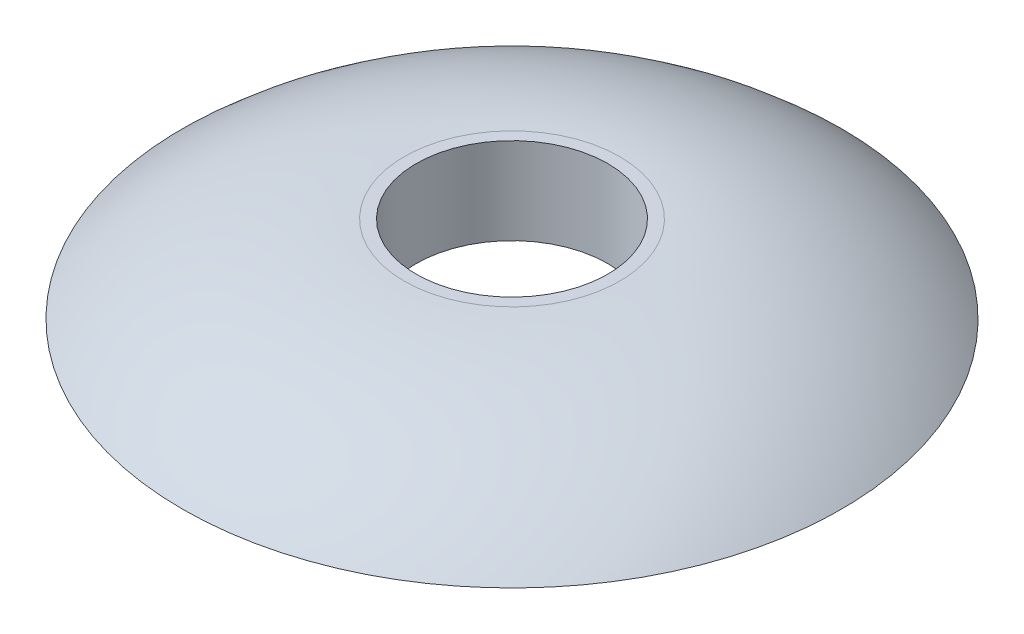
ISO-10303-21;
HEADER;
FILE_DESCRIPTION(('STEP AP214'),'2;1');
FILE_NAME('part.step','',(''),(''),'','','');
FILE_SCHEMA(('AUTOMOTIVE_DESIGN { 1 0 10303 214 1 1 1 1 }'));
ENDSEC;
DATA;
#1=APPLICATION_CONTEXT('core data for automotive mechanical design processes');
#2=APPLICATION_PROTOCOL_DEFINITION('international standard','automotive_design',2000,#1);
#3=PRODUCT_CONTEXT('',#1,'mechanical');
#4=PRODUCT('Part','Part','',(#3));
#5=PRODUCT_RELATED_PRODUCT_CATEGORY('part','',(#4));
#6=PRODUCT_DEFINITION_FORMATION('','',#4);
#7=PRODUCT_DEFINITION_CONTEXT('part definition',#1,'design');
#8=PRODUCT_DEFINITION('design','',#6,#7);
#9=PRODUCT_DEFINITION_SHAPE('','',#8);
#10=(LENGTH_UNIT() NAMED_UNIT(*) SI_UNIT(.MILLI.,.METRE.));
#11=(NAMED_UNIT(*) PLANE_ANGLE_UNIT() SI_UNIT($,.RADIAN.));
#12=(NAMED_UNIT(*) SI_UNIT($,.STERADIAN.) SOLID_ANGLE_UNIT());
#13=UNCERTAINTY_MEASURE_WITH_UNIT(LENGTH_MEASURE(1.E-05),#10,'distance_accuracy_value','');
#14=(GEOMETRIC_REPRESENTATION_CONTEXT(3) GLOBAL_UNCERTAINTY_ASSIGNED_CONTEXT((#13)) GLOBAL_UNIT_ASSIGNED_CONTEXT((#10,
#11,#12)) REPRESENTATION_CONTEXT('',''));
#15=CARTESIAN_POINT('',(0.,0.,0.));
#16=DIRECTION('',(0.,0.,1.));
#17=DIRECTION('',(1.,0.,0.));
#18=AXIS2_PLACEMENT_3D('',#15,#16,#17);
#19=CARTESIAN_POINT('',(-39.6875,0.,0.));
#20=DIRECTION('',(0.,1.,0.));
#21=DIRECTION('',(0.,0.,1.));
#22=AXIS2_PLACEMENT_3D('',#19,#20,#21);
#23=PLANE('',#22);
#24=CARTESIAN_POINT('',(0.,0.,0.));
#25=DIRECTION('',(0.,-1.,0.));
#26=DIRECTION('',(0.,0.,-1.));
#27=AXIS2_PLACEMENT_3D('',#24,#25,#26);
#28=CIRCLE('',#27,12.7);
#29=CARTESIAN_POINT('',(0.,0.,-12.7));
#30=VERTEX_POINT('',#29);
#31=EDGE_CURVE('E42',#30,#30,#28,.T.);
#32=ORIENTED_EDGE('',*,*,#31,.F.);
#33=EDGE_LOOP('',(#32));
#34=FACE_BOUND('',#33,.T.);
#35=CARTESIAN_POINT('',(0.,0.,0.));
#36=DIRECTION('',(0.,-1.,0.));
#37=DIRECTION('',(0.,0.,-1.));
#38=AXIS2_PLACEMENT_3D('',#35,#36,#37);
#39=CIRCLE('',#38,39.6875);
#40=CARTESIAN_POINT('',(0.,0.,-39.6875));
#41=VERTEX_POINT('',#40);
#42=EDGE_CURVE('E66',#41,#41,#39,.T.);
#43=ORIENTED_EDGE('',*,*,#42,.T.);
#44=EDGE_LOOP('',(#43));
#45=FACE_BOUND('',#44,.T.);
#46=ADVANCED_FACE('F31',(#34,#45),#23,.F.);
#47=CARTESIAN_POINT('',(0.,0.,0.));
#48=DIRECTION('',(0.,-1.,0.));
#49=DIRECTION('',(0.,0.,-1.));
#50=AXIS2_PLACEMENT_3D('',#47,#48,#49);
#51=CYLINDRICAL_SURFACE('',#50,12.7);
#52=CARTESIAN_POINT('',(0.,11.4788461538462,0.));
#53=DIRECTION('',(0.,-1.,0.));
#54=DIRECTION('',(0.,0.,-1.));
#55=AXIS2_PLACEMENT_3D('',#52,#53,#54);
#56=CIRCLE('',#55,12.7);
#57=CARTESIAN_POINT('',(0.,11.4788461538462,-12.7));
#58=VERTEX_POINT('',#57);
#59=EDGE_CURVE('E46',#58,#58,#56,.T.);
#60=ORIENTED_EDGE('',*,*,#59,.F.);
#61=EDGE_LOOP('',(#60));
#62=FACE_BOUND('',#61,.T.);
#63=ORIENTED_EDGE('',*,*,#31,.T.);
#64=EDGE_LOOP('',(#63));
#65=FACE_BOUND('',#64,.T.);
#66=ADVANCED_FACE('F87',(#62,#65),#51,.F.);
#67=CARTESIAN_POINT('',(-12.7,11.4788461538462,0.));
#68=DIRECTION('',(0.,-1.,0.));
#69=DIRECTION('',(0.,0.,-1.));
#70=AXIS2_PLACEMENT_3D('',#67,#68,#69);
#71=PLANE('',#70);
#72=CARTESIAN_POINT('',(0.,11.4788461538462,0.));
#73=DIRECTION('',(0.,-1.,0.));
#74=DIRECTION('',(0.,0.,-1.));
#75=AXIS2_PLACEMENT_3D('',#72,#73,#74);
#76=CIRCLE('',#75,14.2875);
#77=CARTESIAN_POINT('',(0.,11.4788461538462,-14.2875));
#78=VERTEX_POINT('',#77);
#79=EDGE_CURVE('E51',#78,#78,#76,.T.);
#80=ORIENTED_EDGE('',*,*,#79,.F.);
#81=EDGE_LOOP('',(#80));
#82=FACE_BOUND('',#81,.T.);
#83=ORIENTED_EDGE('',*,*,#59,.T.);
#84=EDGE_LOOP('',(#83));
#85=FACE_BOUND('',#84,.T.);
#86=ADVANCED_FACE('F92',(#82,#85),#71,.F.);
#87=CARTESIAN_POINT('',(0.,-31.8706077872745,0.));
#88=DIRECTION('',(0.,-1.,0.));
#89=DIRECTION('',(0.,0.,-1.));
#90=AXIS2_PLACEMENT_3D('',#87,#88,#89);
#91=DEGENERATE_TOROIDAL_SURFACE('',#90,14.2875,43.3494539411206,.T.);
#92=CARTESIAN_POINT('',(0.,0.,0.));
#93=DIRECTION('',(0.,-1.,0.));
#94=DIRECTION('',(0.,0.,-1.));
#95=AXIS2_PLACEMENT_3D('',#92,#93,#94);
#96=CIRCLE('',#95,43.6718413447206);
#97=CARTESIAN_POINT('',(0.,0.,-43.6718413447206));
#98=VERTEX_POINT('',#97);
#99=EDGE_CURVE('E54',#98,#98,#96,.T.);
#100=ORIENTED_EDGE('',*,*,#99,.F.);
#101=EDGE_LOOP('',(#100));
#102=FACE_BOUND('',#101,.T.);
#103=ORIENTED_EDGE('',*,*,#79,.T.);
#104=EDGE_LOOP('',(#103));
#105=FACE_BOUND('',#104,.T.);
#106=ADVANCED_FACE('F99',(#102,#105),#91,.T.);
#107=CARTESIAN_POINT('',(-43.6718413447206,0.,0.));
#108=DIRECTION('',(0.,1.,0.));
#109=DIRECTION('',(0.,0.,1.));
#110=AXIS2_PLACEMENT_3D('',#107,#108,#109);
#111=PLANE('',#110);
#112=CARTESIAN_POINT('',(0.,0.,0.));
#113=DIRECTION('',(0.,-1.,0.));
#114=DIRECTION('',(0.,0.,-1.));
#115=AXIS2_PLACEMENT_3D('',#112,#113,#114);
#116=CIRCLE('',#115,41.275);
#117=CARTESIAN_POINT('',(0.,0.,-41.275));
#118=VERTEX_POINT('',#117);
#119=EDGE_CURVE('E57',#118,#118,#116,.T.);
#120=ORIENTED_EDGE('',*,*,#119,.F.);
#121=EDGE_LOOP('',(#120));
#122=FACE_BOUND('',#121,.T.);
#123=ORIENTED_EDGE('',*,*,#99,.T.);
#124=EDGE_LOOP('',(#123));
#125=FACE_BOUND('',#124,.T.);
#126=ADVANCED_FACE('F103',(#122,#125),#111,.F.);
#127=CARTESIAN_POINT('',(0.,-31.8706077872745,0.));
#128=DIRECTION('',(0.,-1.,0.));
#129=DIRECTION('',(0.,0.,-1.));
#130=AXIS2_PLACEMENT_3D('',#127,#128,#129);
#131=DEGENERATE_TOROIDAL_SURFACE('',#130,14.2875,41.7619539411206,.T.);
#132=CARTESIAN_POINT('',(0.,9.89134615384615,0.));
#133=DIRECTION('',(0.,-1.,0.));
#134=DIRECTION('',(0.,0.,-1.));
#135=AXIS2_PLACEMENT_3D('',#132,#133,#134);
#136=CIRCLE('',#135,14.2875);
#137=CARTESIAN_POINT('',(0.,9.89134615384615,-14.2875));
#138=VERTEX_POINT('',#137);
#139=EDGE_CURVE('E60',#138,#138,#136,.T.);
#140=ORIENTED_EDGE('',*,*,#139,.F.);
#141=EDGE_LOOP('',(#140));
#142=FACE_BOUND('',#141,.T.);
#143=ORIENTED_EDGE('',*,*,#119,.T.);
#144=EDGE_LOOP('',(#143));
#145=FACE_BOUND('',#144,.T.);
#146=ADVANCED_FACE('F84',(#142,#145),#131,.F.);
#147=CARTESIAN_POINT('',(0.,0.,0.));
#148=DIRECTION('',(0.,-1.,0.));
#149=DIRECTION('',(0.,0.,-1.));
#150=AXIS2_PLACEMENT_3D('',#147,#148,#149);
#151=CYLINDRICAL_SURFACE('',#150,14.2875);
#152=CARTESIAN_POINT('',(0.,4.49384615384615,0.));
#153=DIRECTION('',(0.,-1.,0.));
#154=DIRECTION('',(0.,0.,-1.));
#155=AXIS2_PLACEMENT_3D('',#152,#153,#154);
#156=CIRCLE('',#155,14.2875);
#157=CARTESIAN_POINT('',(0.,4.49384615384615,-14.2875));
#158=VERTEX_POINT('',#157);
#159=EDGE_CURVE('E10',#158,#158,#156,.F.);
#160=ORIENTED_EDGE('',*,*,#159,.T.);
#161=EDGE_LOOP('',(#160));
#162=FACE_BOUND('',#161,.T.);
#163=ORIENTED_EDGE('',*,*,#139,.T.);
#164=EDGE_LOOP('',(#163));
#165=FACE_BOUND('',#164,.T.);
#166=ADVANCED_FACE('F79',(#162,#165),#151,.T.);
#167=CARTESIAN_POINT('',(-14.2875,1.95384615384615,0.));
#168=DIRECTION('',(0.,-1.,0.));
#169=DIRECTION('',(0.,0.,-1.));
#170=AXIS2_PLACEMENT_3D('',#167,#168,#169);
#171=PLANE('',#170);
#172=CARTESIAN_POINT('',(0.,1.95384615384615,0.));
#173=DIRECTION('',(0.,-1.,0.));
#174=DIRECTION('',(0.,0.,-1.));
#175=AXIS2_PLACEMENT_3D('',#172,#173,#174);
#176=CIRCLE('',#175,16.8275);
#177=CARTESIAN_POINT('',(0.,1.95384615384615,-16.8275));
#178=VERTEX_POINT('',#177);
#179=EDGE_CURVE('E38',#178,#178,#176,.T.);
#180=ORIENTED_EDGE('',*,*,#179,.T.);
#181=EDGE_LOOP('',(#180));
#182=FACE_BOUND('',#181,.T.);
#183=CARTESIAN_POINT('',(0.,1.95384615384615,0.));
#184=DIRECTION('',(0.,-1.,0.));
#185=DIRECTION('',(0.,0.,-1.));
#186=AXIS2_PLACEMENT_3D('',#183,#184,#185);
#187=CIRCLE('',#186,37.7336538461539);
#188=CARTESIAN_POINT('',(0.,1.95384615384615,-37.7336538461539));
#189=VERTEX_POINT('',#188);
#190=EDGE_CURVE('E63',#189,#189,#187,.T.);
#191=ORIENTED_EDGE('',*,*,#190,.F.);
#192=EDGE_LOOP('',(#191));
#193=FACE_BOUND('',#192,.T.);
#194=ADVANCED_FACE('F74',(#182,#193),#171,.F.);
#195=CARTESIAN_POINT('',(0.,1.95384615384615,0.));
#196=DIRECTION('',(0.,-1.,0.));
#197=DIRECTION('',(0.,0.,-1.));
#198=AXIS2_PLACEMENT_3D('',#195,#196,#197);
#199=CONICAL_SURFACE('',#198,37.7336538461539,0.785398163397446);
#200=ORIENTED_EDGE('',*,*,#42,.F.);
#201=EDGE_LOOP('',(#200));
#202=FACE_BOUND('',#201,.T.);
#203=ORIENTED_EDGE('',*,*,#190,.T.);
#204=EDGE_LOOP('',(#203));
#205=FACE_BOUND('',#204,.T.);
#206=ADVANCED_FACE('F71',(#202,#205),#199,.T.);
#207=CARTESIAN_POINT('',(0.,4.49384615384615,0.));
#208=DIRECTION('',(0.,-1.,0.));
#209=DIRECTION('',(0.,0.,-1.));
#210=AXIS2_PLACEMENT_3D('',#207,#208,#209);
#211=TOROIDAL_SURFACE('',#210,16.8275,2.54);
#212=ORIENTED_EDGE('',*,*,#159,.F.);
#213=EDGE_LOOP('',(#212));
#214=FACE_BOUND('',#213,.T.);
#215=ORIENTED_EDGE('',*,*,#179,.F.);
#216=EDGE_LOOP('',(#215));
#217=FACE_BOUND('',#216,.T.);
#218=ADVANCED_FACE('F33',(#214,#217),#211,.F.);
#219=CLOSED_SHELL('',(#46,#66,#86,#106,#126,#146,#166,#194,#206,#218));
#220=MANIFOLD_SOLID_BREP('B2',#219);
#221=ADVANCED_BREP_SHAPE_REPRESENTATION('',(#18,#220),#14);
#222=SHAPE_DEFINITION_REPRESENTATION(#9,#221);
ENDSEC;
END-ISO-10303-21;
